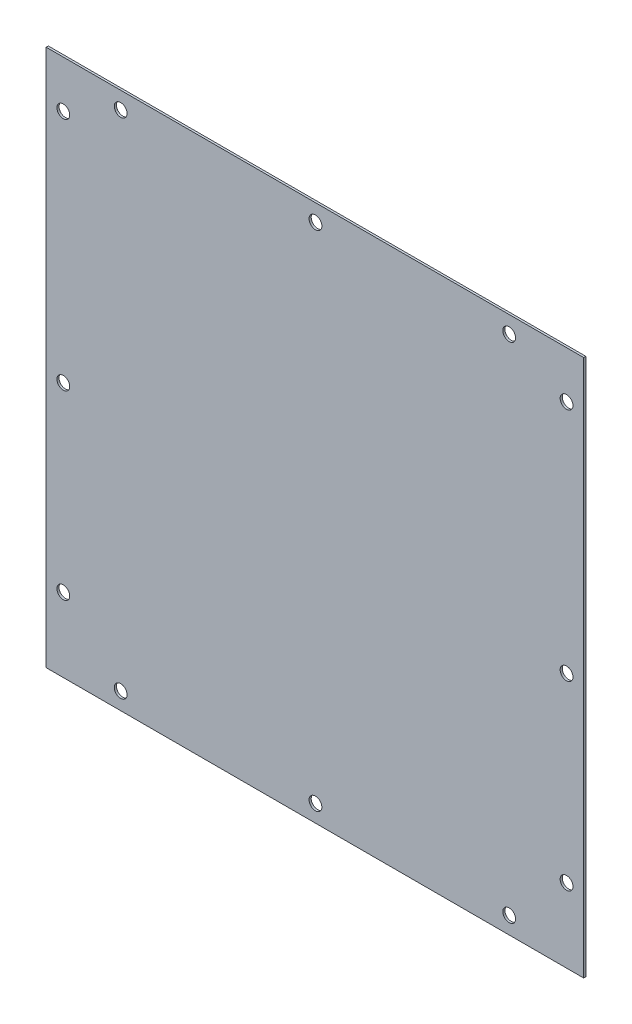
ISO-10303-21;
HEADER;
FILE_DESCRIPTION(('STEP AP214'),'2;1');
FILE_NAME('part.step','',(''),(''),'','','');
FILE_SCHEMA(('AUTOMOTIVE_DESIGN { 1 0 10303 214 1 1 1 1 }'));
ENDSEC;
DATA;
#1=APPLICATION_CONTEXT('core data for automotive mechanical design processes');
#2=APPLICATION_PROTOCOL_DEFINITION('international standard','automotive_design',2000,#1);
#3=PRODUCT_CONTEXT('',#1,'mechanical');
#4=PRODUCT('Part','Part','',(#3));
#5=PRODUCT_RELATED_PRODUCT_CATEGORY('part','',(#4));
#6=PRODUCT_DEFINITION_FORMATION('','',#4);
#7=PRODUCT_DEFINITION_CONTEXT('part definition',#1,'design');
#8=PRODUCT_DEFINITION('design','',#6,#7);
#9=PRODUCT_DEFINITION_SHAPE('','',#8);
#10=(LENGTH_UNIT() NAMED_UNIT(*) SI_UNIT(.MILLI.,.METRE.));
#11=(NAMED_UNIT(*) PLANE_ANGLE_UNIT() SI_UNIT($,.RADIAN.));
#12=(NAMED_UNIT(*) SI_UNIT($,.STERADIAN.) SOLID_ANGLE_UNIT());
#13=UNCERTAINTY_MEASURE_WITH_UNIT(LENGTH_MEASURE(1.E-05),#10,'distance_accuracy_value','');
#14=(GEOMETRIC_REPRESENTATION_CONTEXT(3) GLOBAL_UNCERTAINTY_ASSIGNED_CONTEXT((#13)) GLOBAL_UNIT_ASSIGNED_CONTEXT((#10,
#11,#12)) REPRESENTATION_CONTEXT('',''));
#15=CARTESIAN_POINT('',(0.,0.,0.));
#16=DIRECTION('',(0.,0.,1.));
#17=DIRECTION('',(1.,0.,0.));
#18=AXIS2_PLACEMENT_3D('',#15,#16,#17);
#19=CARTESIAN_POINT('',(0.,0.,1.5875));
#20=DIRECTION('',(0.,0.,-1.));
#21=DIRECTION('',(-1.,0.,0.));
#22=AXIS2_PLACEMENT_3D('',#19,#20,#21);
#23=PLANE('',#22);
#24=DIRECTION('',(0.,-1.,0.));
#25=VECTOR('',#24,1.);
#26=CARTESIAN_POINT('',(0.,0.,1.5875));
#27=LINE('',#26,#25);
#28=CARTESIAN_POINT('',(-1.11022302462516E-13,400.,1.5875));
#29=VERTEX_POINT('',#28);
#30=CARTESIAN_POINT('',(0.,0.,1.5875));
#31=VERTEX_POINT('',#30);
#32=EDGE_CURVE('E92',#29,#31,#27,.T.);
#33=ORIENTED_EDGE('',*,*,#32,.T.);
#34=DIRECTION('',(1.,0.,0.));
#35=VECTOR('',#34,1.);
#36=CARTESIAN_POINT('',(0.,0.,1.5875));
#37=LINE('',#36,#35);
#38=CARTESIAN_POINT('',(400.,0.,1.5875));
#39=VERTEX_POINT('',#38);
#40=EDGE_CURVE('E87',#31,#39,#37,.T.);
#41=ORIENTED_EDGE('',*,*,#40,.T.);
#42=DIRECTION('',(0.,1.,0.));
#43=VECTOR('',#42,1.);
#44=CARTESIAN_POINT('',(400.,0.,1.5875));
#45=LINE('',#44,#43);
#46=CARTESIAN_POINT('',(400.,400.,1.5875));
#47=VERTEX_POINT('',#46);
#48=EDGE_CURVE('E90',#39,#47,#45,.T.);
#49=ORIENTED_EDGE('',*,*,#48,.T.);
#50=DIRECTION('',(-1.,0.,0.));
#51=VECTOR('',#50,1.);
#52=CARTESIAN_POINT('',(-1.11022302462516E-13,400.,1.5875));
#53=LINE('',#52,#51);
#54=EDGE_CURVE('E57',#47,#29,#53,.T.);
#55=ORIENTED_EDGE('',*,*,#54,.T.);
#56=EDGE_LOOP('',(#33,#41,#49,#55));
#57=FACE_BOUND('',#56,.T.);
#58=CARTESIAN_POINT('',(55.4,387.3,1.5875));
#59=DIRECTION('',(0.,0.,1.));
#60=DIRECTION('',(1.,0.,0.));
#61=AXIS2_PLACEMENT_3D('',#58,#59,#60);
#62=CIRCLE('',#61,4.7625);
#63=CARTESIAN_POINT('',(60.1625,387.3,1.5875));
#64=VERTEX_POINT('',#63);
#65=EDGE_CURVE('E112',#64,#64,#62,.T.);
#66=ORIENTED_EDGE('',*,*,#65,.F.);
#67=EDGE_LOOP('',(#66));
#68=FACE_BOUND('',#67,.T.);
#69=CARTESIAN_POINT('',(200.4,387.3,1.5875));
#70=DIRECTION('',(0.,0.,1.));
#71=DIRECTION('',(1.,0.,0.));
#72=AXIS2_PLACEMENT_3D('',#69,#70,#71);
#73=CIRCLE('',#72,4.76250000000001);
#74=CARTESIAN_POINT('',(205.1625,387.3,1.5875));
#75=VERTEX_POINT('',#74);
#76=EDGE_CURVE('E134',#75,#75,#73,.T.);
#77=ORIENTED_EDGE('',*,*,#76,.F.);
#78=EDGE_LOOP('',(#77));
#79=FACE_BOUND('',#78,.T.);
#80=CARTESIAN_POINT('',(344.6,387.3,1.5875));
#81=DIRECTION('',(0.,0.,1.));
#82=DIRECTION('',(1.,0.,0.));
#83=AXIS2_PLACEMENT_3D('',#80,#81,#82);
#84=CIRCLE('',#83,4.76250000000001);
#85=CARTESIAN_POINT('',(349.3625,387.3,1.5875));
#86=VERTEX_POINT('',#85);
#87=EDGE_CURVE('E142',#86,#86,#84,.T.);
#88=ORIENTED_EDGE('',*,*,#87,.F.);
#89=EDGE_LOOP('',(#88));
#90=FACE_BOUND('',#89,.T.);
#91=CARTESIAN_POINT('',(12.7,365.,1.5875));
#92=DIRECTION('',(0.,0.,1.));
#93=DIRECTION('',(1.,0.,0.));
#94=AXIS2_PLACEMENT_3D('',#91,#92,#93);
#95=CIRCLE('',#94,4.7625);
#96=CARTESIAN_POINT('',(17.4625,365.,1.5875));
#97=VERTEX_POINT('',#96);
#98=EDGE_CURVE('E150',#97,#97,#95,.T.);
#99=ORIENTED_EDGE('',*,*,#98,.F.);
#100=EDGE_LOOP('',(#99));
#101=FACE_BOUND('',#100,.T.);
#102=CARTESIAN_POINT('',(12.7,190.,1.5875));
#103=DIRECTION('',(0.,0.,1.));
#104=DIRECTION('',(1.,0.,0.));
#105=AXIS2_PLACEMENT_3D('',#102,#103,#104);
#106=CIRCLE('',#105,4.7625);
#107=CARTESIAN_POINT('',(17.4625,190.,1.5875));
#108=VERTEX_POINT('',#107);
#109=EDGE_CURVE('E158',#108,#108,#106,.T.);
#110=ORIENTED_EDGE('',*,*,#109,.F.);
#111=EDGE_LOOP('',(#110));
#112=FACE_BOUND('',#111,.T.);
#113=CARTESIAN_POINT('',(12.7,55.,1.5875));
#114=DIRECTION('',(0.,0.,1.));
#115=DIRECTION('',(1.,0.,0.));
#116=AXIS2_PLACEMENT_3D('',#113,#114,#115);
#117=CIRCLE('',#116,4.7625);
#118=CARTESIAN_POINT('',(17.4625,55.,1.5875));
#119=VERTEX_POINT('',#118);
#120=EDGE_CURVE('E166',#119,#119,#117,.T.);
#121=ORIENTED_EDGE('',*,*,#120,.F.);
#122=EDGE_LOOP('',(#121));
#123=FACE_BOUND('',#122,.T.);
#124=CARTESIAN_POINT('',(387.3,365.,1.5875));
#125=DIRECTION('',(0.,0.,1.));
#126=DIRECTION('',(1.,0.,0.));
#127=AXIS2_PLACEMENT_3D('',#124,#125,#126);
#128=CIRCLE('',#127,4.76250000000001);
#129=CARTESIAN_POINT('',(392.0625,365.,1.5875));
#130=VERTEX_POINT('',#129);
#131=EDGE_CURVE('E174',#130,#130,#128,.T.);
#132=ORIENTED_EDGE('',*,*,#131,.F.);
#133=EDGE_LOOP('',(#132));
#134=FACE_BOUND('',#133,.T.);
#135=CARTESIAN_POINT('',(387.3,190.,1.5875));
#136=DIRECTION('',(0.,0.,1.));
#137=DIRECTION('',(1.,0.,0.));
#138=AXIS2_PLACEMENT_3D('',#135,#136,#137);
#139=CIRCLE('',#138,4.76250000000001);
#140=CARTESIAN_POINT('',(392.0625,190.,1.5875));
#141=VERTEX_POINT('',#140);
#142=EDGE_CURVE('E182',#141,#141,#139,.T.);
#143=ORIENTED_EDGE('',*,*,#142,.F.);
#144=EDGE_LOOP('',(#143));
#145=FACE_BOUND('',#144,.T.);
#146=CARTESIAN_POINT('',(387.3,55.,1.5875));
#147=DIRECTION('',(0.,0.,1.));
#148=DIRECTION('',(1.,0.,0.));
#149=AXIS2_PLACEMENT_3D('',#146,#147,#148);
#150=CIRCLE('',#149,4.76250000000001);
#151=CARTESIAN_POINT('',(392.0625,55.,1.5875));
#152=VERTEX_POINT('',#151);
#153=EDGE_CURVE('E190',#152,#152,#150,.T.);
#154=ORIENTED_EDGE('',*,*,#153,.F.);
#155=EDGE_LOOP('',(#154));
#156=FACE_BOUND('',#155,.T.);
#157=CARTESIAN_POINT('',(344.6,12.7,1.5875));
#158=DIRECTION('',(0.,0.,1.));
#159=DIRECTION('',(1.,0.,0.));
#160=AXIS2_PLACEMENT_3D('',#157,#158,#159);
#161=CIRCLE('',#160,4.76250000000001);
#162=CARTESIAN_POINT('',(349.3625,12.7,1.5875));
#163=VERTEX_POINT('',#162);
#164=EDGE_CURVE('E198',#163,#163,#161,.T.);
#165=ORIENTED_EDGE('',*,*,#164,.F.);
#166=EDGE_LOOP('',(#165));
#167=FACE_BOUND('',#166,.T.);
#168=CARTESIAN_POINT('',(200.4,12.7,1.5875));
#169=DIRECTION('',(0.,0.,1.));
#170=DIRECTION('',(1.,0.,0.));
#171=AXIS2_PLACEMENT_3D('',#168,#169,#170);
#172=CIRCLE('',#171,4.76250000000001);
#173=CARTESIAN_POINT('',(205.1625,12.7,1.5875));
#174=VERTEX_POINT('',#173);
#175=EDGE_CURVE('E206',#174,#174,#172,.T.);
#176=ORIENTED_EDGE('',*,*,#175,.F.);
#177=EDGE_LOOP('',(#176));
#178=FACE_BOUND('',#177,.T.);
#179=CARTESIAN_POINT('',(55.4,12.7,1.5875));
#180=DIRECTION('',(0.,0.,1.));
#181=DIRECTION('',(1.,0.,0.));
#182=AXIS2_PLACEMENT_3D('',#179,#180,#181);
#183=CIRCLE('',#182,4.7625);
#184=CARTESIAN_POINT('',(60.1625,12.7,1.5875));
#185=VERTEX_POINT('',#184);
#186=EDGE_CURVE('E214',#185,#185,#183,.T.);
#187=ORIENTED_EDGE('',*,*,#186,.F.);
#188=EDGE_LOOP('',(#187));
#189=FACE_BOUND('',#188,.T.);
#190=ADVANCED_FACE('F39',(#57,#68,#79,#90,#101,#112,#123,#134,#145,#156,#167,#178,#189),#23,.F.);
#191=CARTESIAN_POINT('',(0.,0.,0.));
#192=DIRECTION('',(0.,0.,-1.));
#193=DIRECTION('',(-1.,0.,0.));
#194=AXIS2_PLACEMENT_3D('',#191,#192,#193);
#195=PLANE('',#194);
#196=CARTESIAN_POINT('',(200.4,12.7,0.));
#197=DIRECTION('',(0.,0.,1.));
#198=DIRECTION('',(1.,0.,0.));
#199=AXIS2_PLACEMENT_3D('',#196,#197,#198);
#200=CIRCLE('',#199,4.76250000000001);
#201=CARTESIAN_POINT('',(205.1625,12.7,0.));
#202=VERTEX_POINT('',#201);
#203=EDGE_CURVE('E210',#202,#202,#200,.T.);
#204=ORIENTED_EDGE('',*,*,#203,.T.);
#205=EDGE_LOOP('',(#204));
#206=FACE_BOUND('',#205,.T.);
#207=CARTESIAN_POINT('',(387.3,55.,0.));
#208=DIRECTION('',(0.,0.,1.));
#209=DIRECTION('',(1.,0.,0.));
#210=AXIS2_PLACEMENT_3D('',#207,#208,#209);
#211=CIRCLE('',#210,4.76250000000001);
#212=CARTESIAN_POINT('',(392.0625,55.,0.));
#213=VERTEX_POINT('',#212);
#214=EDGE_CURVE('E194',#213,#213,#211,.T.);
#215=ORIENTED_EDGE('',*,*,#214,.T.);
#216=EDGE_LOOP('',(#215));
#217=FACE_BOUND('',#216,.T.);
#218=CARTESIAN_POINT('',(387.3,365.,0.));
#219=DIRECTION('',(0.,0.,1.));
#220=DIRECTION('',(1.,0.,0.));
#221=AXIS2_PLACEMENT_3D('',#218,#219,#220);
#222=CIRCLE('',#221,4.76250000000001);
#223=CARTESIAN_POINT('',(392.0625,365.,0.));
#224=VERTEX_POINT('',#223);
#225=EDGE_CURVE('E178',#224,#224,#222,.T.);
#226=ORIENTED_EDGE('',*,*,#225,.T.);
#227=EDGE_LOOP('',(#226));
#228=FACE_BOUND('',#227,.T.);
#229=CARTESIAN_POINT('',(12.7,190.,0.));
#230=DIRECTION('',(0.,0.,1.));
#231=DIRECTION('',(1.,0.,0.));
#232=AXIS2_PLACEMENT_3D('',#229,#230,#231);
#233=CIRCLE('',#232,4.7625);
#234=CARTESIAN_POINT('',(17.4625,190.,0.));
#235=VERTEX_POINT('',#234);
#236=EDGE_CURVE('E162',#235,#235,#233,.T.);
#237=ORIENTED_EDGE('',*,*,#236,.T.);
#238=EDGE_LOOP('',(#237));
#239=FACE_BOUND('',#238,.T.);
#240=CARTESIAN_POINT('',(344.6,387.3,0.));
#241=DIRECTION('',(0.,0.,1.));
#242=DIRECTION('',(1.,0.,0.));
#243=AXIS2_PLACEMENT_3D('',#240,#241,#242);
#244=CIRCLE('',#243,4.76250000000001);
#245=CARTESIAN_POINT('',(349.3625,387.3,0.));
#246=VERTEX_POINT('',#245);
#247=EDGE_CURVE('E146',#246,#246,#244,.T.);
#248=ORIENTED_EDGE('',*,*,#247,.T.);
#249=EDGE_LOOP('',(#248));
#250=FACE_BOUND('',#249,.T.);
#251=CARTESIAN_POINT('',(55.4,387.3,0.));
#252=DIRECTION('',(0.,0.,1.));
#253=DIRECTION('',(1.,0.,0.));
#254=AXIS2_PLACEMENT_3D('',#251,#252,#253);
#255=CIRCLE('',#254,4.7625);
#256=CARTESIAN_POINT('',(60.1625,387.3,0.));
#257=VERTEX_POINT('',#256);
#258=EDGE_CURVE('E130',#257,#257,#255,.T.);
#259=ORIENTED_EDGE('',*,*,#258,.T.);
#260=EDGE_LOOP('',(#259));
#261=FACE_BOUND('',#260,.T.);
#262=DIRECTION('',(0.,-1.,0.));
#263=VECTOR('',#262,1.);
#264=CARTESIAN_POINT('',(0.,0.,0.));
#265=LINE('',#264,#263);
#266=CARTESIAN_POINT('',(-1.11022302462516E-13,400.,0.));
#267=VERTEX_POINT('',#266);
#268=CARTESIAN_POINT('',(0.,0.,0.));
#269=VERTEX_POINT('',#268);
#270=EDGE_CURVE('E108',#267,#269,#265,.T.);
#271=ORIENTED_EDGE('',*,*,#270,.F.);
#272=DIRECTION('',(-1.,0.,0.));
#273=VECTOR('',#272,1.);
#274=CARTESIAN_POINT('',(-1.11022302462516E-13,400.,0.));
#275=LINE('',#274,#273);
#276=CARTESIAN_POINT('',(400.,400.,0.));
#277=VERTEX_POINT('',#276);
#278=EDGE_CURVE('E80',#277,#267,#275,.T.);
#279=ORIENTED_EDGE('',*,*,#278,.F.);
#280=DIRECTION('',(0.,1.,0.));
#281=VECTOR('',#280,1.);
#282=CARTESIAN_POINT('',(400.,0.,0.));
#283=LINE('',#282,#281);
#284=CARTESIAN_POINT('',(400.,0.,0.));
#285=VERTEX_POINT('',#284);
#286=EDGE_CURVE('E74',#285,#277,#283,.T.);
#287=ORIENTED_EDGE('',*,*,#286,.F.);
#288=DIRECTION('',(1.,0.,0.));
#289=VECTOR('',#288,1.);
#290=CARTESIAN_POINT('',(0.,0.,0.));
#291=LINE('',#290,#289);
#292=EDGE_CURVE('E97',#269,#285,#291,.T.);
#293=ORIENTED_EDGE('',*,*,#292,.F.);
#294=EDGE_LOOP('',(#271,#279,#287,#293));
#295=FACE_BOUND('',#294,.T.);
#296=CARTESIAN_POINT('',(200.4,387.3,0.));
#297=DIRECTION('',(0.,0.,1.));
#298=DIRECTION('',(1.,0.,0.));
#299=AXIS2_PLACEMENT_3D('',#296,#297,#298);
#300=CIRCLE('',#299,4.76250000000001);
#301=CARTESIAN_POINT('',(205.1625,387.3,0.));
#302=VERTEX_POINT('',#301);
#303=EDGE_CURVE('E138',#302,#302,#300,.T.);
#304=ORIENTED_EDGE('',*,*,#303,.T.);
#305=EDGE_LOOP('',(#304));
#306=FACE_BOUND('',#305,.T.);
#307=CARTESIAN_POINT('',(12.7,365.,0.));
#308=DIRECTION('',(0.,0.,1.));
#309=DIRECTION('',(1.,0.,0.));
#310=AXIS2_PLACEMENT_3D('',#307,#308,#309);
#311=CIRCLE('',#310,4.7625);
#312=CARTESIAN_POINT('',(17.4625,365.,0.));
#313=VERTEX_POINT('',#312);
#314=EDGE_CURVE('E154',#313,#313,#311,.T.);
#315=ORIENTED_EDGE('',*,*,#314,.T.);
#316=EDGE_LOOP('',(#315));
#317=FACE_BOUND('',#316,.T.);
#318=CARTESIAN_POINT('',(12.7,55.,0.));
#319=DIRECTION('',(0.,0.,1.));
#320=DIRECTION('',(1.,0.,0.));
#321=AXIS2_PLACEMENT_3D('',#318,#319,#320);
#322=CIRCLE('',#321,4.7625);
#323=CARTESIAN_POINT('',(17.4625,55.,0.));
#324=VERTEX_POINT('',#323);
#325=EDGE_CURVE('E170',#324,#324,#322,.T.);
#326=ORIENTED_EDGE('',*,*,#325,.T.);
#327=EDGE_LOOP('',(#326));
#328=FACE_BOUND('',#327,.T.);
#329=CARTESIAN_POINT('',(387.3,190.,0.));
#330=DIRECTION('',(0.,0.,1.));
#331=DIRECTION('',(1.,0.,0.));
#332=AXIS2_PLACEMENT_3D('',#329,#330,#331);
#333=CIRCLE('',#332,4.76250000000001);
#334=CARTESIAN_POINT('',(392.0625,190.,0.));
#335=VERTEX_POINT('',#334);
#336=EDGE_CURVE('E186',#335,#335,#333,.T.);
#337=ORIENTED_EDGE('',*,*,#336,.T.);
#338=EDGE_LOOP('',(#337));
#339=FACE_BOUND('',#338,.T.);
#340=CARTESIAN_POINT('',(344.6,12.7,0.));
#341=DIRECTION('',(0.,0.,1.));
#342=DIRECTION('',(1.,0.,0.));
#343=AXIS2_PLACEMENT_3D('',#340,#341,#342);
#344=CIRCLE('',#343,4.76250000000001);
#345=CARTESIAN_POINT('',(349.3625,12.7,0.));
#346=VERTEX_POINT('',#345);
#347=EDGE_CURVE('E202',#346,#346,#344,.T.);
#348=ORIENTED_EDGE('',*,*,#347,.T.);
#349=EDGE_LOOP('',(#348));
#350=FACE_BOUND('',#349,.T.);
#351=CARTESIAN_POINT('',(55.4,12.7,0.));
#352=DIRECTION('',(0.,0.,1.));
#353=DIRECTION('',(1.,0.,0.));
#354=AXIS2_PLACEMENT_3D('',#351,#352,#353);
#355=CIRCLE('',#354,4.7625);
#356=CARTESIAN_POINT('',(60.1625,12.7,0.));
#357=VERTEX_POINT('',#356);
#358=EDGE_CURVE('E218',#357,#357,#355,.T.);
#359=ORIENTED_EDGE('',*,*,#358,.T.);
#360=EDGE_LOOP('',(#359));
#361=FACE_BOUND('',#360,.T.);
#362=ADVANCED_FACE('F125',(#206,#217,#228,#239,#250,#261,#295,#306,#317,#328,#339,#350,#361),
#195,.T.);
#363=CARTESIAN_POINT('',(0.,0.,1.5875));
#364=DIRECTION('',(1.,0.,0.));
#365=DIRECTION('',(0.,1.,0.));
#366=AXIS2_PLACEMENT_3D('',#363,#364,#365);
#367=PLANE('',#366);
#368=ORIENTED_EDGE('',*,*,#270,.T.);
#369=DIRECTION('',(0.,0.,-1.));
#370=VECTOR('',#369,1.);
#371=CARTESIAN_POINT('',(0.,0.,1.5875));
#372=LINE('',#371,#370);
#373=EDGE_CURVE('E11',#31,#269,#372,.T.);
#374=ORIENTED_EDGE('',*,*,#373,.F.);
#375=ORIENTED_EDGE('',*,*,#32,.F.);
#376=DIRECTION('',(0.,0.,-1.));
#377=VECTOR('',#376,1.);
#378=CARTESIAN_POINT('',(-1.11022302462516E-13,400.,1.5875));
#379=LINE('',#378,#377);
#380=EDGE_CURVE('E104',#29,#267,#379,.T.);
#381=ORIENTED_EDGE('',*,*,#380,.T.);
#382=EDGE_LOOP('',(#368,#374,#375,#381));
#383=FACE_BOUND('',#382,.T.);
#384=ADVANCED_FACE('F41',(#383),#367,.F.);
#385=CARTESIAN_POINT('',(0.,0.,1.5875));
#386=DIRECTION('',(0.,1.,0.));
#387=DIRECTION('',(0.,0.,1.));
#388=AXIS2_PLACEMENT_3D('',#385,#386,#387);
#389=PLANE('',#388);
#390=ORIENTED_EDGE('',*,*,#292,.T.);
#391=DIRECTION('',(0.,0.,-1.));
#392=VECTOR('',#391,1.);
#393=CARTESIAN_POINT('',(400.,0.,1.5875));
#394=LINE('',#393,#392);
#395=EDGE_CURVE('E49',#39,#285,#394,.T.);
#396=ORIENTED_EDGE('',*,*,#395,.F.);
#397=ORIENTED_EDGE('',*,*,#40,.F.);
#398=ORIENTED_EDGE('',*,*,#373,.T.);
#399=EDGE_LOOP('',(#390,#396,#397,#398));
#400=FACE_BOUND('',#399,.T.);
#401=ADVANCED_FACE('F96',(#400),#389,.F.);
#402=CARTESIAN_POINT('',(400.,0.,1.5875));
#403=DIRECTION('',(-1.,0.,0.));
#404=DIRECTION('',(0.,-1.,0.));
#405=AXIS2_PLACEMENT_3D('',#402,#403,#404);
#406=PLANE('',#405);
#407=ORIENTED_EDGE('',*,*,#286,.T.);
#408=DIRECTION('',(0.,0.,-1.));
#409=VECTOR('',#408,1.);
#410=CARTESIAN_POINT('',(400.,400.,1.5875));
#411=LINE('',#410,#409);
#412=EDGE_CURVE('E99',#47,#277,#411,.T.);
#413=ORIENTED_EDGE('',*,*,#412,.F.);
#414=ORIENTED_EDGE('',*,*,#48,.F.);
#415=ORIENTED_EDGE('',*,*,#395,.T.);
#416=EDGE_LOOP('',(#407,#413,#414,#415));
#417=FACE_BOUND('',#416,.T.);
#418=ADVANCED_FACE('F100',(#417),#406,.F.);
#419=CARTESIAN_POINT('',(-1.11022302462516E-13,400.,1.5875));
#420=DIRECTION('',(0.,-1.,0.));
#421=DIRECTION('',(0.,0.,-1.));
#422=AXIS2_PLACEMENT_3D('',#419,#420,#421);
#423=PLANE('',#422);
#424=ORIENTED_EDGE('',*,*,#278,.T.);
#425=ORIENTED_EDGE('',*,*,#380,.F.);
#426=ORIENTED_EDGE('',*,*,#54,.F.);
#427=ORIENTED_EDGE('',*,*,#412,.T.);
#428=EDGE_LOOP('',(#424,#425,#426,#427));
#429=FACE_BOUND('',#428,.T.);
#430=ADVANCED_FACE('F122',(#429),#423,.F.);
#431=CARTESIAN_POINT('',(55.4,387.3,1.5875));
#432=DIRECTION('',(0.,0.,-1.));
#433=DIRECTION('',(-1.,0.,0.));
#434=AXIS2_PLACEMENT_3D('',#431,#432,#433);
#435=CYLINDRICAL_SURFACE('',#434,4.7625);
#436=ORIENTED_EDGE('',*,*,#65,.T.);
#437=EDGE_LOOP('',(#436));
#438=FACE_BOUND('',#437,.T.);
#439=ORIENTED_EDGE('',*,*,#258,.F.);
#440=EDGE_LOOP('',(#439));
#441=FACE_BOUND('',#440,.T.);
#442=ADVANCED_FACE('F237',(#438,#441),#435,.F.);
#443=CARTESIAN_POINT('',(200.4,387.3,1.5875));
#444=DIRECTION('',(0.,0.,-1.));
#445=DIRECTION('',(-1.,0.,0.));
#446=AXIS2_PLACEMENT_3D('',#443,#444,#445);
#447=CYLINDRICAL_SURFACE('',#446,4.76250000000001);
#448=ORIENTED_EDGE('',*,*,#76,.T.);
#449=EDGE_LOOP('',(#448));
#450=FACE_BOUND('',#449,.T.);
#451=ORIENTED_EDGE('',*,*,#303,.F.);
#452=EDGE_LOOP('',(#451));
#453=FACE_BOUND('',#452,.T.);
#454=ADVANCED_FACE('F283',(#450,#453),#447,.F.);
#455=CARTESIAN_POINT('',(344.6,387.3,1.5875));
#456=DIRECTION('',(0.,0.,-1.));
#457=DIRECTION('',(-1.,0.,0.));
#458=AXIS2_PLACEMENT_3D('',#455,#456,#457);
#459=CYLINDRICAL_SURFACE('',#458,4.76250000000001);
#460=ORIENTED_EDGE('',*,*,#87,.T.);
#461=EDGE_LOOP('',(#460));
#462=FACE_BOUND('',#461,.T.);
#463=ORIENTED_EDGE('',*,*,#247,.F.);
#464=EDGE_LOOP('',(#463));
#465=FACE_BOUND('',#464,.T.);
#466=ADVANCED_FACE('F291',(#462,#465),#459,.F.);
#467=CARTESIAN_POINT('',(12.7,365.,1.5875));
#468=DIRECTION('',(0.,0.,-1.));
#469=DIRECTION('',(-1.,0.,0.));
#470=AXIS2_PLACEMENT_3D('',#467,#468,#469);
#471=CYLINDRICAL_SURFACE('',#470,4.7625);
#472=ORIENTED_EDGE('',*,*,#98,.T.);
#473=EDGE_LOOP('',(#472));
#474=FACE_BOUND('',#473,.T.);
#475=ORIENTED_EDGE('',*,*,#314,.F.);
#476=EDGE_LOOP('',(#475));
#477=FACE_BOUND('',#476,.T.);
#478=ADVANCED_FACE('F299',(#474,#477),#471,.F.);
#479=CARTESIAN_POINT('',(12.7,190.,1.5875));
#480=DIRECTION('',(0.,0.,-1.));
#481=DIRECTION('',(-1.,0.,0.));
#482=AXIS2_PLACEMENT_3D('',#479,#480,#481);
#483=CYLINDRICAL_SURFACE('',#482,4.7625);
#484=ORIENTED_EDGE('',*,*,#109,.T.);
#485=EDGE_LOOP('',(#484));
#486=FACE_BOUND('',#485,.T.);
#487=ORIENTED_EDGE('',*,*,#236,.F.);
#488=EDGE_LOOP('',(#487));
#489=FACE_BOUND('',#488,.T.);
#490=ADVANCED_FACE('F308',(#486,#489),#483,.F.);
#491=CARTESIAN_POINT('',(12.7,55.,1.5875));
#492=DIRECTION('',(0.,0.,-1.));
#493=DIRECTION('',(-1.,0.,0.));
#494=AXIS2_PLACEMENT_3D('',#491,#492,#493);
#495=CYLINDRICAL_SURFACE('',#494,4.7625);
#496=ORIENTED_EDGE('',*,*,#120,.T.);
#497=EDGE_LOOP('',(#496));
#498=FACE_BOUND('',#497,.T.);
#499=ORIENTED_EDGE('',*,*,#325,.F.);
#500=EDGE_LOOP('',(#499));
#501=FACE_BOUND('',#500,.T.);
#502=ADVANCED_FACE('F317',(#498,#501),#495,.F.);
#503=CARTESIAN_POINT('',(387.3,365.,1.5875));
#504=DIRECTION('',(0.,0.,-1.));
#505=DIRECTION('',(-1.,0.,0.));
#506=AXIS2_PLACEMENT_3D('',#503,#504,#505);
#507=CYLINDRICAL_SURFACE('',#506,4.76250000000001);
#508=ORIENTED_EDGE('',*,*,#131,.T.);
#509=EDGE_LOOP('',(#508));
#510=FACE_BOUND('',#509,.T.);
#511=ORIENTED_EDGE('',*,*,#225,.F.);
#512=EDGE_LOOP('',(#511));
#513=FACE_BOUND('',#512,.T.);
#514=ADVANCED_FACE('F326',(#510,#513),#507,.F.);
#515=CARTESIAN_POINT('',(387.3,190.,1.5875));
#516=DIRECTION('',(0.,0.,-1.));
#517=DIRECTION('',(-1.,0.,0.));
#518=AXIS2_PLACEMENT_3D('',#515,#516,#517);
#519=CYLINDRICAL_SURFACE('',#518,4.76250000000001);
#520=ORIENTED_EDGE('',*,*,#142,.T.);
#521=EDGE_LOOP('',(#520));
#522=FACE_BOUND('',#521,.T.);
#523=ORIENTED_EDGE('',*,*,#336,.F.);
#524=EDGE_LOOP('',(#523));
#525=FACE_BOUND('',#524,.T.);
#526=ADVANCED_FACE('F335',(#522,#525),#519,.F.);
#527=CARTESIAN_POINT('',(387.3,55.,1.5875));
#528=DIRECTION('',(0.,0.,-1.));
#529=DIRECTION('',(-1.,0.,0.));
#530=AXIS2_PLACEMENT_3D('',#527,#528,#529);
#531=CYLINDRICAL_SURFACE('',#530,4.76250000000001);
#532=ORIENTED_EDGE('',*,*,#153,.T.);
#533=EDGE_LOOP('',(#532));
#534=FACE_BOUND('',#533,.T.);
#535=ORIENTED_EDGE('',*,*,#214,.F.);
#536=EDGE_LOOP('',(#535));
#537=FACE_BOUND('',#536,.T.);
#538=ADVANCED_FACE('F344',(#534,#537),#531,.F.);
#539=CARTESIAN_POINT('',(344.6,12.7,1.5875));
#540=DIRECTION('',(0.,0.,-1.));
#541=DIRECTION('',(-1.,0.,0.));
#542=AXIS2_PLACEMENT_3D('',#539,#540,#541);
#543=CYLINDRICAL_SURFACE('',#542,4.76250000000001);
#544=ORIENTED_EDGE('',*,*,#164,.T.);
#545=EDGE_LOOP('',(#544));
#546=FACE_BOUND('',#545,.T.);
#547=ORIENTED_EDGE('',*,*,#347,.F.);
#548=EDGE_LOOP('',(#547));
#549=FACE_BOUND('',#548,.T.);
#550=ADVANCED_FACE('F353',(#546,#549),#543,.F.);
#551=CARTESIAN_POINT('',(200.4,12.7,1.5875));
#552=DIRECTION('',(0.,0.,-1.));
#553=DIRECTION('',(-1.,0.,0.));
#554=AXIS2_PLACEMENT_3D('',#551,#552,#553);
#555=CYLINDRICAL_SURFACE('',#554,4.76250000000001);
#556=ORIENTED_EDGE('',*,*,#175,.T.);
#557=EDGE_LOOP('',(#556));
#558=FACE_BOUND('',#557,.T.);
#559=ORIENTED_EDGE('',*,*,#203,.F.);
#560=EDGE_LOOP('',(#559));
#561=FACE_BOUND('',#560,.T.);
#562=ADVANCED_FACE('F362',(#558,#561),#555,.F.);
#563=CARTESIAN_POINT('',(55.4,12.7,1.5875));
#564=DIRECTION('',(0.,0.,-1.));
#565=DIRECTION('',(-1.,0.,0.));
#566=AXIS2_PLACEMENT_3D('',#563,#564,#565);
#567=CYLINDRICAL_SURFACE('',#566,4.7625);
#568=ORIENTED_EDGE('',*,*,#186,.T.);
#569=EDGE_LOOP('',(#568));
#570=FACE_BOUND('',#569,.T.);
#571=ORIENTED_EDGE('',*,*,#358,.F.);
#572=EDGE_LOOP('',(#571));
#573=FACE_BOUND('',#572,.T.);
#574=ADVANCED_FACE('F226',(#570,#573),#567,.F.);
#575=CLOSED_SHELL('',(#190,#362,#384,#401,#418,#430,#442,#454,#466,#478,#490,#502,#514,#526,
#538,#550,#562,#574));
#576=MANIFOLD_SOLID_BREP('B2',#575);
#577=ADVANCED_BREP_SHAPE_REPRESENTATION('',(#18,#576),#14);
#578=SHAPE_DEFINITION_REPRESENTATION(#9,#577);
ENDSEC;
END-ISO-10303-21;
